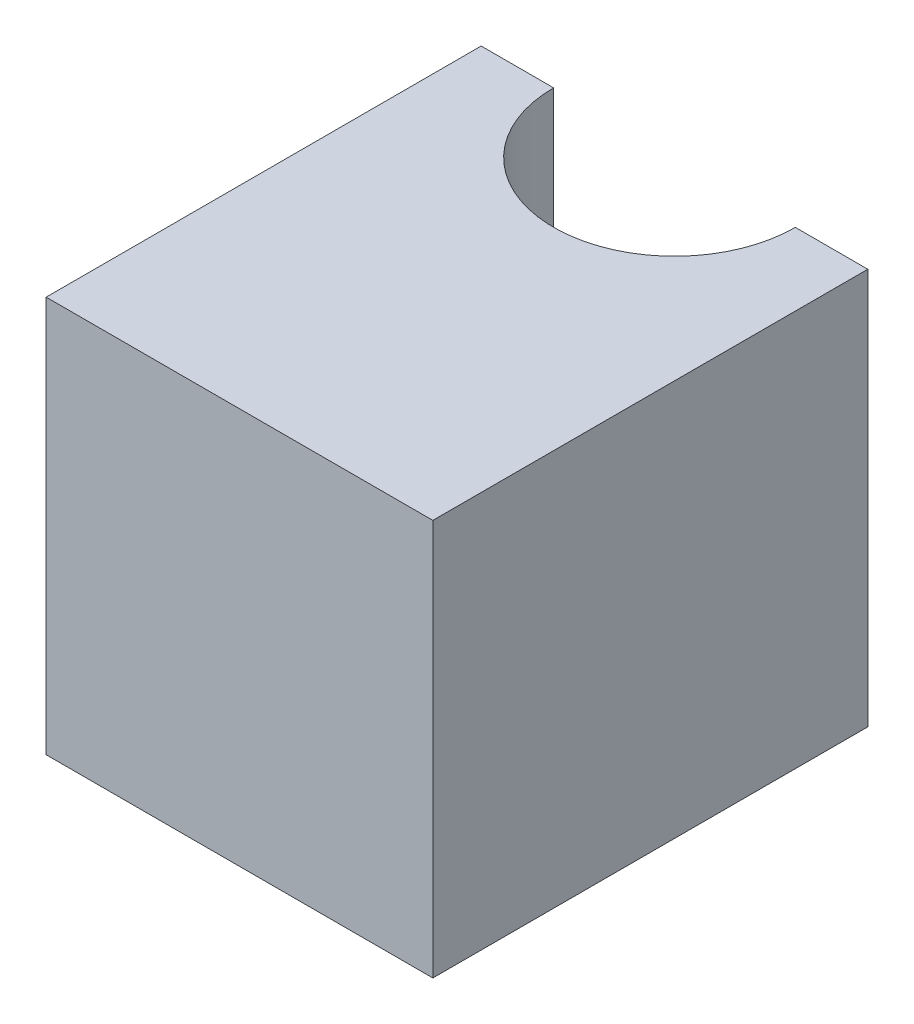
ISO-10303-21;
HEADER;
FILE_DESCRIPTION(('STEP AP214'),'2;1');
FILE_NAME('part.step','',(''),(''),'','','');
FILE_SCHEMA(('AUTOMOTIVE_DESIGN { 1 0 10303 214 1 1 1 1 }'));
ENDSEC;
DATA;
#1=APPLICATION_CONTEXT('core data for automotive mechanical design processes');
#2=APPLICATION_PROTOCOL_DEFINITION('international standard','automotive_design',2000,#1);
#3=PRODUCT_CONTEXT('',#1,'mechanical');
#4=PRODUCT('Part','Part','',(#3));
#5=PRODUCT_RELATED_PRODUCT_CATEGORY('part','',(#4));
#6=PRODUCT_DEFINITION_FORMATION('','',#4);
#7=PRODUCT_DEFINITION_CONTEXT('part definition',#1,'design');
#8=PRODUCT_DEFINITION('design','',#6,#7);
#9=PRODUCT_DEFINITION_SHAPE('','',#8);
#10=(LENGTH_UNIT() NAMED_UNIT(*) SI_UNIT(.MILLI.,.METRE.));
#11=(NAMED_UNIT(*) PLANE_ANGLE_UNIT() SI_UNIT($,.RADIAN.));
#12=(NAMED_UNIT(*) SI_UNIT($,.STERADIAN.) SOLID_ANGLE_UNIT());
#13=UNCERTAINTY_MEASURE_WITH_UNIT(LENGTH_MEASURE(1.E-05),#10,'distance_accuracy_value','');
#14=(GEOMETRIC_REPRESENTATION_CONTEXT(3) GLOBAL_UNCERTAINTY_ASSIGNED_CONTEXT((#13)) GLOBAL_UNIT_ASSIGNED_CONTEXT((#10,
#11,#12)) REPRESENTATION_CONTEXT('',''));
#15=CARTESIAN_POINT('',(0.,0.,0.));
#16=DIRECTION('',(0.,0.,1.));
#17=DIRECTION('',(1.,0.,0.));
#18=AXIS2_PLACEMENT_3D('',#15,#16,#17);
#19=CARTESIAN_POINT('',(-4.8,0.,-6.1));
#20=DIRECTION('',(0.,1.,0.));
#21=DIRECTION('',(0.,0.,1.));
#22=AXIS2_PLACEMENT_3D('',#19,#20,#21);
#23=CYLINDRICAL_SURFACE('',#22,0.25);
#24=DIRECTION('',(0.,1.,0.));
#25=VECTOR('',#24,1.);
#26=CARTESIAN_POINT('',(-5.05,0.,-6.1));
#27=LINE('',#26,#25);
#28=CARTESIAN_POINT('',(-5.05,0.82,-6.1));
#29=VERTEX_POINT('',#28);
#30=CARTESIAN_POINT('',(-5.05,0.,-6.1));
#31=VERTEX_POINT('',#30);
#32=EDGE_CURVE('E119',#29,#31,#27,.F.);
#33=ORIENTED_EDGE('',*,*,#32,.F.);
#34=CARTESIAN_POINT('',(-4.8,0.82,-6.1));
#35=DIRECTION('',(0.,1.,0.));
#36=DIRECTION('',(0.,0.,1.));
#37=AXIS2_PLACEMENT_3D('',#34,#35,#36);
#38=CIRCLE('',#37,0.25);
#39=CARTESIAN_POINT('',(-4.55,0.82,-6.1));
#40=VERTEX_POINT('',#39);
#41=EDGE_CURVE('E80',#40,#29,#38,.F.);
#42=ORIENTED_EDGE('',*,*,#41,.F.);
#43=DIRECTION('',(0.,1.,0.));
#44=VECTOR('',#43,1.);
#45=CARTESIAN_POINT('',(-4.55,0.,-6.1));
#46=LINE('',#45,#44);
#47=CARTESIAN_POINT('',(-4.55,0.,-6.1));
#48=VERTEX_POINT('',#47);
#49=EDGE_CURVE('E78',#48,#40,#46,.T.);
#50=ORIENTED_EDGE('',*,*,#49,.F.);
#51=CARTESIAN_POINT('',(-4.8,0.,-6.1));
#52=DIRECTION('',(0.,1.,0.));
#53=DIRECTION('',(0.,0.,1.));
#54=AXIS2_PLACEMENT_3D('',#51,#52,#53);
#55=CIRCLE('',#54,0.25);
#56=EDGE_CURVE('E20',#48,#31,#55,.F.);
#57=ORIENTED_EDGE('',*,*,#56,.T.);
#58=EDGE_LOOP('',(#33,#42,#50,#57));
#59=FACE_BOUND('',#58,.T.);
#60=ADVANCED_FACE('F17',(#59),#23,.F.);
#61=CARTESIAN_POINT('',(-5.05,0.,-6.1));
#62=DIRECTION('',(0.,0.,-1.));
#63=DIRECTION('',(-1.,0.,0.));
#64=AXIS2_PLACEMENT_3D('',#61,#62,#63);
#65=PLANE('',#64);
#66=DIRECTION('',(1.,0.,0.));
#67=VECTOR('',#66,1.);
#68=CARTESIAN_POINT('',(-4.8,0.82,-6.1));
#69=LINE('',#68,#67);
#70=CARTESIAN_POINT('',(-5.2,0.82,-6.1));
#71=VERTEX_POINT('',#70);
#72=EDGE_CURVE('E104',#29,#71,#69,.F.);
#73=ORIENTED_EDGE('',*,*,#72,.F.);
#74=ORIENTED_EDGE('',*,*,#32,.T.);
#75=DIRECTION('',(1.,0.,0.));
#76=VECTOR('',#75,1.);
#77=CARTESIAN_POINT('',(-4.8,0.,-6.1));
#78=LINE('',#77,#76);
#79=CARTESIAN_POINT('',(-5.2,0.,-6.1));
#80=VERTEX_POINT('',#79);
#81=EDGE_CURVE('E73',#31,#80,#78,.F.);
#82=ORIENTED_EDGE('',*,*,#81,.T.);
#83=DIRECTION('',(0.,1.,0.));
#84=VECTOR('',#83,1.);
#85=CARTESIAN_POINT('',(-5.2,0.,-6.1));
#86=LINE('',#85,#84);
#87=EDGE_CURVE('E76',#71,#80,#86,.F.);
#88=ORIENTED_EDGE('',*,*,#87,.F.);
#89=EDGE_LOOP('',(#73,#74,#82,#88));
#90=FACE_BOUND('',#89,.T.);
#91=ADVANCED_FACE('F196',(#90),#65,.T.);
#92=CARTESIAN_POINT('',(-5.2,0.,-6.1));
#93=DIRECTION('',(-1.,0.,0.));
#94=DIRECTION('',(0.,0.,1.));
#95=AXIS2_PLACEMENT_3D('',#92,#93,#94);
#96=PLANE('',#95);
#97=DIRECTION('',(0.,0.,1.));
#98=VECTOR('',#97,1.);
#99=CARTESIAN_POINT('',(-5.2,0.82,-5.65));
#100=LINE('',#99,#98);
#101=CARTESIAN_POINT('',(-5.2,0.82,-5.2));
#102=VERTEX_POINT('',#101);
#103=EDGE_CURVE('E83',#71,#102,#100,.T.);
#104=ORIENTED_EDGE('',*,*,#103,.F.);
#105=ORIENTED_EDGE('',*,*,#87,.T.);
#106=DIRECTION('',(0.,0.,1.));
#107=VECTOR('',#106,1.);
#108=CARTESIAN_POINT('',(-5.2,0.,-5.65));
#109=LINE('',#108,#107);
#110=CARTESIAN_POINT('',(-5.2,0.,-5.2));
#111=VERTEX_POINT('',#110);
#112=EDGE_CURVE('E89',#80,#111,#109,.T.);
#113=ORIENTED_EDGE('',*,*,#112,.T.);
#114=DIRECTION('',(0.,1.,0.));
#115=VECTOR('',#114,1.);
#116=CARTESIAN_POINT('',(-5.2,0.,-5.2));
#117=LINE('',#116,#115);
#118=EDGE_CURVE('E100',#102,#111,#117,.F.);
#119=ORIENTED_EDGE('',*,*,#118,.F.);
#120=EDGE_LOOP('',(#104,#105,#113,#119));
#121=FACE_BOUND('',#120,.T.);
#122=ADVANCED_FACE('F187',(#121),#96,.T.);
#123=CARTESIAN_POINT('',(-4.8,0.,-5.65));
#124=DIRECTION('',(0.,1.,0.));
#125=DIRECTION('',(0.,0.,1.));
#126=AXIS2_PLACEMENT_3D('',#123,#124,#125);
#127=PLANE('',#126);
#128=ORIENTED_EDGE('',*,*,#81,.F.);
#129=ORIENTED_EDGE('',*,*,#56,.F.);
#130=DIRECTION('',(-1.,0.,0.));
#131=VECTOR('',#130,1.);
#132=CARTESIAN_POINT('',(-4.4,0.,-6.1));
#133=LINE('',#132,#131);
#134=CARTESIAN_POINT('',(-4.4,0.,-6.1));
#135=VERTEX_POINT('',#134);
#136=EDGE_CURVE('E70',#135,#48,#133,.T.);
#137=ORIENTED_EDGE('',*,*,#136,.F.);
#138=DIRECTION('',(0.,0.,-1.));
#139=VECTOR('',#138,1.);
#140=CARTESIAN_POINT('',(-4.4,0.,-5.2));
#141=LINE('',#140,#139);
#142=CARTESIAN_POINT('',(-4.4,0.,-5.2));
#143=VERTEX_POINT('',#142);
#144=EDGE_CURVE('E98',#143,#135,#141,.T.);
#145=ORIENTED_EDGE('',*,*,#144,.F.);
#146=DIRECTION('',(1.,0.,0.));
#147=VECTOR('',#146,1.);
#148=CARTESIAN_POINT('',(-5.2,0.,-5.2));
#149=LINE('',#148,#147);
#150=EDGE_CURVE('E107',#111,#143,#149,.T.);
#151=ORIENTED_EDGE('',*,*,#150,.F.);
#152=ORIENTED_EDGE('',*,*,#112,.F.);
#153=EDGE_LOOP('',(#128,#129,#137,#145,#151,#152));
#154=FACE_BOUND('',#153,.T.);
#155=ADVANCED_FACE('F68',(#154),#127,.F.);
#156=CARTESIAN_POINT('',(-4.4,0.,-6.1));
#157=DIRECTION('',(0.,0.,-1.));
#158=DIRECTION('',(-1.,0.,0.));
#159=AXIS2_PLACEMENT_3D('',#156,#157,#158);
#160=PLANE('',#159);
#161=DIRECTION('',(1.,0.,0.));
#162=VECTOR('',#161,1.);
#163=CARTESIAN_POINT('',(-4.8,0.82,-6.1));
#164=LINE('',#163,#162);
#165=CARTESIAN_POINT('',(-4.4,0.82,-6.1));
#166=VERTEX_POINT('',#165);
#167=EDGE_CURVE('E105',#166,#40,#164,.F.);
#168=ORIENTED_EDGE('',*,*,#167,.F.);
#169=DIRECTION('',(0.,1.,0.));
#170=VECTOR('',#169,1.);
#171=CARTESIAN_POINT('',(-4.4,0.,-6.1));
#172=LINE('',#171,#170);
#173=EDGE_CURVE('E87',#135,#166,#172,.T.);
#174=ORIENTED_EDGE('',*,*,#173,.F.);
#175=ORIENTED_EDGE('',*,*,#136,.T.);
#176=ORIENTED_EDGE('',*,*,#49,.T.);
#177=EDGE_LOOP('',(#168,#174,#175,#176));
#178=FACE_BOUND('',#177,.T.);
#179=ADVANCED_FACE('F85',(#178),#160,.T.);
#180=CARTESIAN_POINT('',(-4.8,0.82,-5.65));
#181=DIRECTION('',(0.,1.,0.));
#182=DIRECTION('',(0.,0.,1.));
#183=AXIS2_PLACEMENT_3D('',#180,#181,#182);
#184=PLANE('',#183);
#185=ORIENTED_EDGE('',*,*,#41,.T.);
#186=ORIENTED_EDGE('',*,*,#72,.T.);
#187=ORIENTED_EDGE('',*,*,#103,.T.);
#188=DIRECTION('',(1.,0.,0.));
#189=VECTOR('',#188,1.);
#190=CARTESIAN_POINT('',(-5.2,0.82,-5.2));
#191=LINE('',#190,#189);
#192=CARTESIAN_POINT('',(-4.4,0.82,-5.2));
#193=VERTEX_POINT('',#192);
#194=EDGE_CURVE('E35',#193,#102,#191,.F.);
#195=ORIENTED_EDGE('',*,*,#194,.F.);
#196=DIRECTION('',(0.,0.,-1.));
#197=VECTOR('',#196,1.);
#198=CARTESIAN_POINT('',(-4.4,0.82,-5.2));
#199=LINE('',#198,#197);
#200=EDGE_CURVE('E26',#166,#193,#199,.F.);
#201=ORIENTED_EDGE('',*,*,#200,.F.);
#202=ORIENTED_EDGE('',*,*,#167,.T.);
#203=EDGE_LOOP('',(#185,#186,#187,#195,#201,#202));
#204=FACE_BOUND('',#203,.T.);
#205=ADVANCED_FACE('F145',(#204),#184,.T.);
#206=CARTESIAN_POINT('',(-5.2,0.,-5.2));
#207=DIRECTION('',(0.,0.,1.));
#208=DIRECTION('',(1.,0.,0.));
#209=AXIS2_PLACEMENT_3D('',#206,#207,#208);
#210=PLANE('',#209);
#211=ORIENTED_EDGE('',*,*,#194,.T.);
#212=ORIENTED_EDGE('',*,*,#118,.T.);
#213=ORIENTED_EDGE('',*,*,#150,.T.);
#214=DIRECTION('',(0.,1.,0.));
#215=VECTOR('',#214,1.);
#216=CARTESIAN_POINT('',(-4.4,0.,-5.2));
#217=LINE('',#216,#215);
#218=EDGE_CURVE('E11',#193,#143,#217,.F.);
#219=ORIENTED_EDGE('',*,*,#218,.F.);
#220=EDGE_LOOP('',(#211,#212,#213,#219));
#221=FACE_BOUND('',#220,.T.);
#222=ADVANCED_FACE('F141',(#221),#210,.T.);
#223=CARTESIAN_POINT('',(-4.4,0.,-5.2));
#224=DIRECTION('',(1.,0.,0.));
#225=DIRECTION('',(0.,0.,-1.));
#226=AXIS2_PLACEMENT_3D('',#223,#224,#225);
#227=PLANE('',#226);
#228=ORIENTED_EDGE('',*,*,#200,.T.);
#229=ORIENTED_EDGE('',*,*,#218,.T.);
#230=ORIENTED_EDGE('',*,*,#144,.T.);
#231=ORIENTED_EDGE('',*,*,#173,.T.);
#232=EDGE_LOOP('',(#228,#229,#230,#231));
#233=FACE_BOUND('',#232,.T.);
#234=ADVANCED_FACE('F144',(#233),#227,.T.);
#235=CLOSED_SHELL('',(#60,#91,#122,#155,#179,#205,#222,#234));
#236=MANIFOLD_SOLID_BREP('B1',#235);
#237=ADVANCED_BREP_SHAPE_REPRESENTATION('',(#18,#236),#14);
#238=SHAPE_DEFINITION_REPRESENTATION(#9,#237);
ENDSEC;
END-ISO-10303-21;
